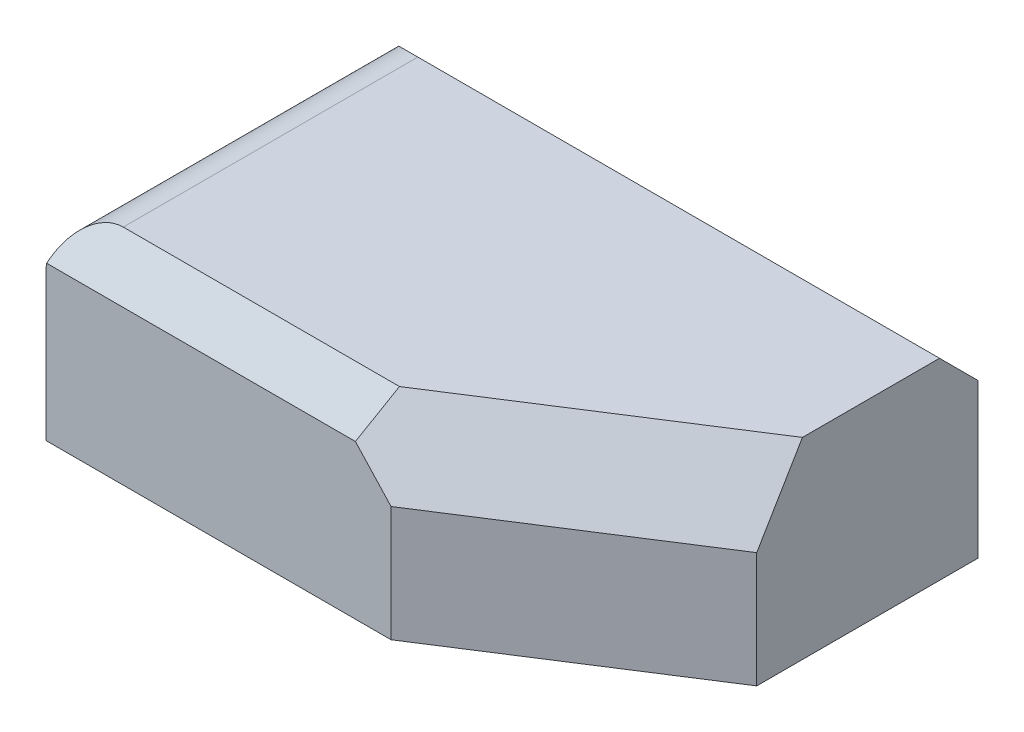
ISO-10303-21;
HEADER;
FILE_DESCRIPTION(('STEP AP214'),'2;1');
FILE_NAME('part.step','',(''),(''),'','','');
FILE_SCHEMA(('AUTOMOTIVE_DESIGN { 1 0 10303 214 1 1 1 1 }'));
ENDSEC;
DATA;
#1=APPLICATION_CONTEXT('core data for automotive mechanical design processes');
#2=APPLICATION_PROTOCOL_DEFINITION('international standard','automotive_design',2000,#1);
#3=PRODUCT_CONTEXT('',#1,'mechanical');
#4=PRODUCT('Part','Part','',(#3));
#5=PRODUCT_RELATED_PRODUCT_CATEGORY('part','',(#4));
#6=PRODUCT_DEFINITION_FORMATION('','',#4);
#7=PRODUCT_DEFINITION_CONTEXT('part definition',#1,'design');
#8=PRODUCT_DEFINITION('design','',#6,#7);
#9=PRODUCT_DEFINITION_SHAPE('','',#8);
#10=(LENGTH_UNIT() NAMED_UNIT(*) SI_UNIT(.MILLI.,.METRE.));
#11=(NAMED_UNIT(*) PLANE_ANGLE_UNIT() SI_UNIT($,.RADIAN.));
#12=(NAMED_UNIT(*) SI_UNIT($,.STERADIAN.) SOLID_ANGLE_UNIT());
#13=UNCERTAINTY_MEASURE_WITH_UNIT(LENGTH_MEASURE(1.E-05),#10,'distance_accuracy_value','');
#14=(GEOMETRIC_REPRESENTATION_CONTEXT(3) GLOBAL_UNCERTAINTY_ASSIGNED_CONTEXT((#13)) GLOBAL_UNIT_ASSIGNED_CONTEXT((#10,
#11,#12)) REPRESENTATION_CONTEXT('',''));
#15=CARTESIAN_POINT('',(0.,0.,0.));
#16=DIRECTION('',(0.,0.,1.));
#17=DIRECTION('',(1.,0.,0.));
#18=AXIS2_PLACEMENT_3D('',#15,#16,#17);
#19=CARTESIAN_POINT('',(-73.7954197537251,40.,-47.3217265685322));
#20=DIRECTION('',(0.,0.707106781186547,-0.707106781186548));
#21=DIRECTION('',(-1.,0.,0.));
#22=AXIS2_PLACEMENT_3D('',#19,#20,#21);
#23=PLANE('',#22);
#24=DIRECTION('',(1.,0.,0.));
#25=VECTOR('',#24,1.);
#26=CARTESIAN_POINT('',(-73.7954197537251,40.,-47.3217265685322));
#27=LINE('',#26,#25);
#28=CARTESIAN_POINT('',(-73.6275793199243,40.,-47.3217265685322));
#29=VERTEX_POINT('',#28);
#30=CARTESIAN_POINT('',(73.7954197537251,40.,-47.3217265685322));
#31=VERTEX_POINT('',#30);
#32=EDGE_CURVE('E127',#29,#31,#27,.T.);
#33=ORIENTED_EDGE('',*,*,#32,.F.);
#34=CARTESIAN_POINT('',(-61.7954197537251,38.,-49.3217265685322));
#35=DIRECTION('',(0.,0.707106781186547,-0.707106781186548));
#36=DIRECTION('',(0.,-0.707106781186548,-0.707106781186547));
#37=AXIS2_PLACEMENT_3D('',#34,#35,#36);
#38=ELLIPSE('',#37,16.9705627484771,12.);
#39=CARTESIAN_POINT('',(-61.7954197537251,50.,-37.3217265685322));
#40=VERTEX_POINT('',#39);
#41=EDGE_CURVE('E13',#29,#40,#38,.T.);
#42=ORIENTED_EDGE('',*,*,#41,.T.);
#43=DIRECTION('',(-1.,0.,0.));
#44=VECTOR('',#43,1.);
#45=CARTESIAN_POINT('',(-73.7954197537251,50.,-37.3217265685322));
#46=LINE('',#45,#44);
#47=CARTESIAN_POINT('',(73.7954197537251,50.,-37.3217265685322));
#48=VERTEX_POINT('',#47);
#49=EDGE_CURVE('E116',#48,#40,#46,.T.);
#50=ORIENTED_EDGE('',*,*,#49,.F.);
#51=DIRECTION('',(0.,-0.707106781186548,-0.707106781186548));
#52=VECTOR('',#51,1.);
#53=CARTESIAN_POINT('',(73.7954197537251,45.,-42.3217265685322));
#54=LINE('',#53,#52);
#55=EDGE_CURVE('E118',#48,#31,#54,.T.);
#56=ORIENTED_EDGE('',*,*,#55,.T.);
#57=EDGE_LOOP('',(#33,#42,#50,#56));
#58=FACE_BOUND('',#57,.T.);
#59=ADVANCED_FACE('F45',(#58),#23,.T.);
#60=CARTESIAN_POINT('',(0.,50.,0.));
#61=DIRECTION('',(0.,1.,0.));
#62=DIRECTION('',(0.,0.,1.));
#63=AXIS2_PLACEMENT_3D('',#60,#61,#62);
#64=PLANE('',#63);
#65=ORIENTED_EDGE('',*,*,#49,.T.);
#66=DIRECTION('',(0.,0.,1.));
#67=VECTOR('',#66,1.);
#68=CARTESIAN_POINT('',(-61.7954197537251,50.,39.2238862365821));
#69=LINE('',#68,#67);
#70=CARTESIAN_POINT('',(-61.7954197537251,50.,39.2238862365821));
#71=VERTEX_POINT('',#70);
#72=EDGE_CURVE('E126',#40,#71,#69,.T.);
#73=ORIENTED_EDGE('',*,*,#72,.T.);
#74=DIRECTION('',(1.,0.,0.));
#75=VECTOR('',#74,1.);
#76=CARTESIAN_POINT('',(15.8842159111157,50.,39.2238862365821));
#77=LINE('',#76,#75);
#78=CARTESIAN_POINT('',(9.98705042094012,50.,39.2238862365821));
#79=VERTEX_POINT('',#78);
#80=EDGE_CURVE('E178',#71,#79,#77,.T.);
#81=ORIENTED_EDGE('',*,*,#80,.T.);
#82=DIRECTION('',(0.841791176983891,0.,-0.539803310801329));
#83=VECTOR('',#82,1.);
#84=CARTESIAN_POINT('',(68.3973866457117,50.,1.7679307202487));
#85=LINE('',#84,#83);
#86=CARTESIAN_POINT('',(73.7954197537251,50.,-1.69358826829795));
#87=VERTEX_POINT('',#86);
#88=EDGE_CURVE('E141',#79,#87,#85,.T.);
#89=ORIENTED_EDGE('',*,*,#88,.T.);
#90=DIRECTION('',(0.,0.,-1.));
#91=VECTOR('',#90,1.);
#92=CARTESIAN_POINT('',(73.7954197537251,50.,-47.3217265685322));
#93=LINE('',#92,#91);
#94=EDGE_CURVE('E132',#87,#48,#93,.T.);
#95=ORIENTED_EDGE('',*,*,#94,.T.);
#96=EDGE_LOOP('',(#65,#73,#81,#89,#95));
#97=FACE_BOUND('',#96,.T.);
#98=ADVANCED_FACE('F139',(#97),#64,.T.);
#99=CARTESIAN_POINT('',(-73.7954197537251,50.,-47.3217265685322));
#100=DIRECTION('',(1.,0.,0.));
#101=DIRECTION('',(0.,0.,-1.));
#102=AXIS2_PLACEMENT_3D('',#99,#100,#101);
#103=PLANE('',#102);
#104=DIRECTION('',(0.,-1.,0.));
#105=VECTOR('',#104,1.);
#106=CARTESIAN_POINT('',(-73.7954197537251,50.,47.3217265685322));
#107=LINE('',#106,#105);
#108=CARTESIAN_POINT('',(-73.7954197537251,38.,47.3217265685322));
#109=VERTEX_POINT('',#108);
#110=CARTESIAN_POINT('',(-73.7954197537251,0.,47.3217265685322));
#111=VERTEX_POINT('',#110);
#112=EDGE_CURVE('E175',#109,#111,#107,.T.);
#113=ORIENTED_EDGE('',*,*,#112,.F.);
#114=DIRECTION('',(0.,0.,1.));
#115=VECTOR('',#114,1.);
#116=CARTESIAN_POINT('',(-73.7954197537251,38.,-37.3217265685322));
#117=LINE('',#116,#115);
#118=CARTESIAN_POINT('',(-73.7954197537251,38.,-47.3217265685322));
#119=VERTEX_POINT('',#118);
#120=EDGE_CURVE('E68',#109,#119,#117,.F.);
#121=ORIENTED_EDGE('',*,*,#120,.T.);
#122=DIRECTION('',(0.,-1.,0.));
#123=VECTOR('',#122,1.);
#124=CARTESIAN_POINT('',(-73.7954197537251,50.,-47.3217265685322));
#125=LINE('',#124,#123);
#126=CARTESIAN_POINT('',(-73.7954197537251,0.,-47.3217265685322));
#127=VERTEX_POINT('',#126);
#128=EDGE_CURVE('E143',#119,#127,#125,.T.);
#129=ORIENTED_EDGE('',*,*,#128,.T.);
#130=DIRECTION('',(0.,0.,1.));
#131=VECTOR('',#130,1.);
#132=CARTESIAN_POINT('',(-73.7954197537251,0.,-47.3217265685322));
#133=LINE('',#132,#131);
#134=EDGE_CURVE('E153',#127,#111,#133,.T.);
#135=ORIENTED_EDGE('',*,*,#134,.T.);
#136=EDGE_LOOP('',(#113,#121,#129,#135));
#137=FACE_BOUND('',#136,.T.);
#138=ADVANCED_FACE('F217',(#137),#103,.F.);
#139=CARTESIAN_POINT('',(-73.7954197537251,50.,47.3217265685322));
#140=DIRECTION('',(0.,0.,-1.));
#141=DIRECTION('',(-1.,0.,0.));
#142=AXIS2_PLACEMENT_3D('',#139,#140,#141);
#143=PLANE('',#142);
#144=DIRECTION('',(-1.,0.,0.));
#145=VECTOR('',#144,1.);
#146=CARTESIAN_POINT('',(-73.7954197537251,40.,47.3217265685322));
#147=LINE('',#146,#145);
#148=CARTESIAN_POINT('',(6.6215828372696,40.,47.3217265685322));
#149=VERTEX_POINT('',#148);
#150=CARTESIAN_POINT('',(-73.6275793199243,40.,47.3217265685322));
#151=VERTEX_POINT('',#150);
#152=EDGE_CURVE('E181',#149,#151,#147,.T.);
#153=ORIENTED_EDGE('',*,*,#152,.T.);
#154=CARTESIAN_POINT('',(-61.7954197537251,38.,47.3217265685322));
#155=DIRECTION('',(0.,0.,-1.));
#156=DIRECTION('',(-1.,0.,0.));
#157=AXIS2_PLACEMENT_3D('',#154,#155,#156);
#158=CIRCLE('',#157,12.);
#159=EDGE_CURVE('E206',#151,#109,#158,.F.);
#160=ORIENTED_EDGE('',*,*,#159,.T.);
#161=ORIENTED_EDGE('',*,*,#112,.T.);
#162=DIRECTION('',(1.,0.,0.));
#163=VECTOR('',#162,1.);
#164=CARTESIAN_POINT('',(-73.7954197537251,0.,47.3217265685322));
#165=LINE('',#164,#163);
#166=CARTESIAN_POINT('',(15.8842159111157,0.,47.3217265685322));
#167=VERTEX_POINT('',#166);
#168=EDGE_CURVE('E157',#111,#167,#165,.T.);
#169=ORIENTED_EDGE('',*,*,#168,.T.);
#170=DIRECTION('',(0.,-1.,0.));
#171=VECTOR('',#170,1.);
#172=CARTESIAN_POINT('',(15.8842159111157,50.,47.3217265685322));
#173=LINE('',#172,#171);
#174=CARTESIAN_POINT('',(15.8842159111157,29.9999999999999,47.3217265685322));
#175=VERTEX_POINT('',#174);
#176=EDGE_CURVE('E172',#175,#167,#173,.T.);
#177=ORIENTED_EDGE('',*,*,#176,.F.);
#178=DIRECTION('',(-0.679541283868778,0.733637269717108,0.));
#179=VECTOR('',#178,1.);
#180=CARTESIAN_POINT('',(8.15276532239168,38.3469252501801,47.3217265685322));
#181=LINE('',#180,#179);
#182=EDGE_CURVE('E193',#175,#149,#181,.T.);
#183=ORIENTED_EDGE('',*,*,#182,.T.);
#184=EDGE_LOOP('',(#153,#160,#161,#169,#177,#183));
#185=FACE_BOUND('',#184,.T.);
#186=ADVANCED_FACE('F213',(#185),#143,.F.);
#187=CARTESIAN_POINT('',(15.8842159111157,50.,47.3217265685322));
#188=DIRECTION('',(-0.539803310801329,0.,-0.84179117698389));
#189=DIRECTION('',(-0.84179117698389,0.,0.539803310801329));
#190=AXIS2_PLACEMENT_3D('',#187,#188,#189);
#191=PLANE('',#190);
#192=DIRECTION('',(0.,-1.,0.));
#193=VECTOR('',#192,1.);
#194=CARTESIAN_POINT('',(73.7954197537251,50.,10.1858424900876));
#195=LINE('',#194,#193);
#196=CARTESIAN_POINT('',(73.7954197537251,29.9999999999999,10.1858424900876));
#197=VERTEX_POINT('',#196);
#198=CARTESIAN_POINT('',(73.7954197537251,0.,10.1858424900876));
#199=VERTEX_POINT('',#198);
#200=EDGE_CURVE('E169',#197,#199,#195,.T.);
#201=ORIENTED_EDGE('',*,*,#200,.F.);
#202=DIRECTION('',(-0.84179117698389,0.,0.539803310801329));
#203=VECTOR('',#202,1.);
#204=CARTESIAN_POINT('',(28.5123165686323,29.9999999999999,39.2238862365821));
#205=LINE('',#204,#203);
#206=EDGE_CURVE('E190',#197,#175,#205,.T.);
#207=ORIENTED_EDGE('',*,*,#206,.T.);
#208=ORIENTED_EDGE('',*,*,#176,.T.);
#209=DIRECTION('',(0.84179117698389,0.,-0.539803310801329));
#210=VECTOR('',#209,1.);
#211=CARTESIAN_POINT('',(15.8842159111157,0.,47.3217265685322));
#212=LINE('',#211,#210);
#213=EDGE_CURVE('E161',#167,#199,#212,.T.);
#214=ORIENTED_EDGE('',*,*,#213,.T.);
#215=EDGE_LOOP('',(#201,#207,#208,#214));
#216=FACE_BOUND('',#215,.T.);
#217=ADVANCED_FACE('F229',(#216),#191,.F.);
#218=CARTESIAN_POINT('',(73.7954197537251,50.,-47.3217265685322));
#219=DIRECTION('',(-1.,0.,0.));
#220=DIRECTION('',(0.,0.,1.));
#221=AXIS2_PLACEMENT_3D('',#218,#219,#220);
#222=PLANE('',#221);
#223=ORIENTED_EDGE('',*,*,#55,.F.);
#224=ORIENTED_EDGE('',*,*,#94,.F.);
#225=DIRECTION('',(0.,-0.859771117205528,0.51067957274514));
#226=VECTOR('',#225,1.);
#227=CARTESIAN_POINT('',(73.7954197537251,35.0601769191473,7.18024142327803));
#228=LINE('',#227,#226);
#229=EDGE_CURVE('E187',#87,#197,#228,.T.);
#230=ORIENTED_EDGE('',*,*,#229,.T.);
#231=ORIENTED_EDGE('',*,*,#200,.T.);
#232=DIRECTION('',(0.,0.,-1.));
#233=VECTOR('',#232,1.);
#234=CARTESIAN_POINT('',(73.7954197537251,0.,-47.3217265685322));
#235=LINE('',#234,#233);
#236=CARTESIAN_POINT('',(73.7954197537251,0.,-47.3217265685322));
#237=VERTEX_POINT('',#236);
#238=EDGE_CURVE('E150',#199,#237,#235,.T.);
#239=ORIENTED_EDGE('',*,*,#238,.T.);
#240=DIRECTION('',(0.,-1.,0.));
#241=VECTOR('',#240,1.);
#242=CARTESIAN_POINT('',(73.7954197537251,50.,-47.3217265685322));
#243=LINE('',#242,#241);
#244=EDGE_CURVE('E134',#31,#237,#243,.T.);
#245=ORIENTED_EDGE('',*,*,#244,.F.);
#246=EDGE_LOOP('',(#223,#224,#230,#231,#239,#245));
#247=FACE_BOUND('',#246,.T.);
#248=ADVANCED_FACE('F131',(#247),#222,.F.);
#249=CARTESIAN_POINT('',(-73.7954197537251,50.,-47.3217265685322));
#250=DIRECTION('',(0.,0.,1.));
#251=DIRECTION('',(1.,0.,0.));
#252=AXIS2_PLACEMENT_3D('',#249,#250,#251);
#253=PLANE('',#252);
#254=ORIENTED_EDGE('',*,*,#128,.F.);
#255=CARTESIAN_POINT('',(-61.7954197537251,38.,-47.3217265685322));
#256=DIRECTION('',(0.,0.,1.));
#257=DIRECTION('',(1.,0.,0.));
#258=AXIS2_PLACEMENT_3D('',#255,#256,#257);
#259=CIRCLE('',#258,12.);
#260=EDGE_CURVE('E54',#119,#29,#259,.F.);
#261=ORIENTED_EDGE('',*,*,#260,.T.);
#262=ORIENTED_EDGE('',*,*,#32,.T.);
#263=ORIENTED_EDGE('',*,*,#244,.T.);
#264=DIRECTION('',(-1.,0.,0.));
#265=VECTOR('',#264,1.);
#266=CARTESIAN_POINT('',(-73.7954197537251,0.,-47.3217265685322));
#267=LINE('',#266,#265);
#268=EDGE_CURVE('E144',#237,#127,#267,.T.);
#269=ORIENTED_EDGE('',*,*,#268,.T.);
#270=EDGE_LOOP('',(#254,#261,#262,#263,#269));
#271=FACE_BOUND('',#270,.T.);
#272=ADVANCED_FACE('F236',(#271),#253,.F.);
#273=CARTESIAN_POINT('',(0.,0.,0.));
#274=DIRECTION('',(0.,1.,0.));
#275=DIRECTION('',(0.,0.,1.));
#276=AXIS2_PLACEMENT_3D('',#273,#274,#275);
#277=PLANE('',#276);
#278=ORIENTED_EDGE('',*,*,#134,.F.);
#279=ORIENTED_EDGE('',*,*,#268,.F.);
#280=ORIENTED_EDGE('',*,*,#238,.F.);
#281=ORIENTED_EDGE('',*,*,#213,.F.);
#282=ORIENTED_EDGE('',*,*,#168,.F.);
#283=EDGE_LOOP('',(#278,#279,#280,#281,#282));
#284=FACE_BOUND('',#283,.T.);
#285=ADVANCED_FACE('F235',(#284),#277,.F.);
#286=CARTESIAN_POINT('',(0.,50.,39.2238862365821));
#287=DIRECTION('',(0.,0.629320391049836,0.777145961456972));
#288=DIRECTION('',(-1.,0.,0.));
#289=AXIS2_PLACEMENT_3D('',#286,#287,#288);
#290=PLANE('',#289);
#291=ORIENTED_EDGE('',*,*,#80,.F.);
#292=CARTESIAN_POINT('',(-61.7954197537251,38.,48.9412946349222));
#293=DIRECTION('',(0.,0.629320391049836,0.777145961456972));
#294=DIRECTION('',(0.,0.777145961456972,-0.629320391049836));
#295=AXIS2_PLACEMENT_3D('',#292,#293,#294);
#296=ELLIPSE('',#295,15.441114790718,12.);
#297=EDGE_CURVE('E203',#71,#151,#296,.T.);
#298=ORIENTED_EDGE('',*,*,#297,.T.);
#299=ORIENTED_EDGE('',*,*,#152,.F.);
#300=DIRECTION('',(0.253034529040139,0.751855493328423,-0.608840573767311));
#301=VECTOR('',#300,1.);
#302=CARTESIAN_POINT('',(9.34761480794704,48.1000095912507,40.762468132811));
#303=LINE('',#302,#301);
#304=EDGE_CURVE('E136',#149,#79,#303,.T.);
#305=ORIENTED_EDGE('',*,*,#304,.T.);
#306=EDGE_LOOP('',(#291,#298,#299,#305));
#307=FACE_BOUND('',#306,.T.);
#308=ADVANCED_FACE('F221',(#307),#290,.T.);
#309=CARTESIAN_POINT('',(20.733501984328,50.,32.3326639336024));
#310=DIRECTION('',(0.482814758972488,0.447213595499956,0.752920917838215));
#311=DIRECTION('',(-0.84179117698389,0.,0.539803310801329));
#312=AXIS2_PLACEMENT_3D('',#309,#310,#311);
#313=PLANE('',#312);
#314=ORIENTED_EDGE('',*,*,#182,.F.);
#315=ORIENTED_EDGE('',*,*,#206,.F.);
#316=ORIENTED_EDGE('',*,*,#229,.F.);
#317=ORIENTED_EDGE('',*,*,#88,.F.);
#318=ORIENTED_EDGE('',*,*,#304,.F.);
#319=EDGE_LOOP('',(#314,#315,#316,#317,#318));
#320=FACE_BOUND('',#319,.T.);
#321=ADVANCED_FACE('F225',(#320),#313,.T.);
#322=CARTESIAN_POINT('',(-61.7954197537251,38.,0.));
#323=DIRECTION('',(0.,0.,-1.));
#324=DIRECTION('',(-1.,0.,0.));
#325=AXIS2_PLACEMENT_3D('',#322,#323,#324);
#326=CYLINDRICAL_SURFACE('',#325,12.);
#327=ORIENTED_EDGE('',*,*,#260,.F.);
#328=ORIENTED_EDGE('',*,*,#120,.F.);
#329=ORIENTED_EDGE('',*,*,#159,.F.);
#330=ORIENTED_EDGE('',*,*,#297,.F.);
#331=ORIENTED_EDGE('',*,*,#72,.F.);
#332=ORIENTED_EDGE('',*,*,#41,.F.);
#333=EDGE_LOOP('',(#327,#328,#329,#330,#331,#332));
#334=FACE_BOUND('',#333,.T.);
#335=ADVANCED_FACE('F47',(#334),#326,.T.);
#336=CLOSED_SHELL('',(#59,#98,#138,#186,#217,#248,#272,#285,#308,#321,#335));
#337=MANIFOLD_SOLID_BREP('B2',#336);
#338=ADVANCED_BREP_SHAPE_REPRESENTATION('',(#18,#337),#14);
#339=SHAPE_DEFINITION_REPRESENTATION(#9,#338);
ENDSEC;
END-ISO-10303-21;
